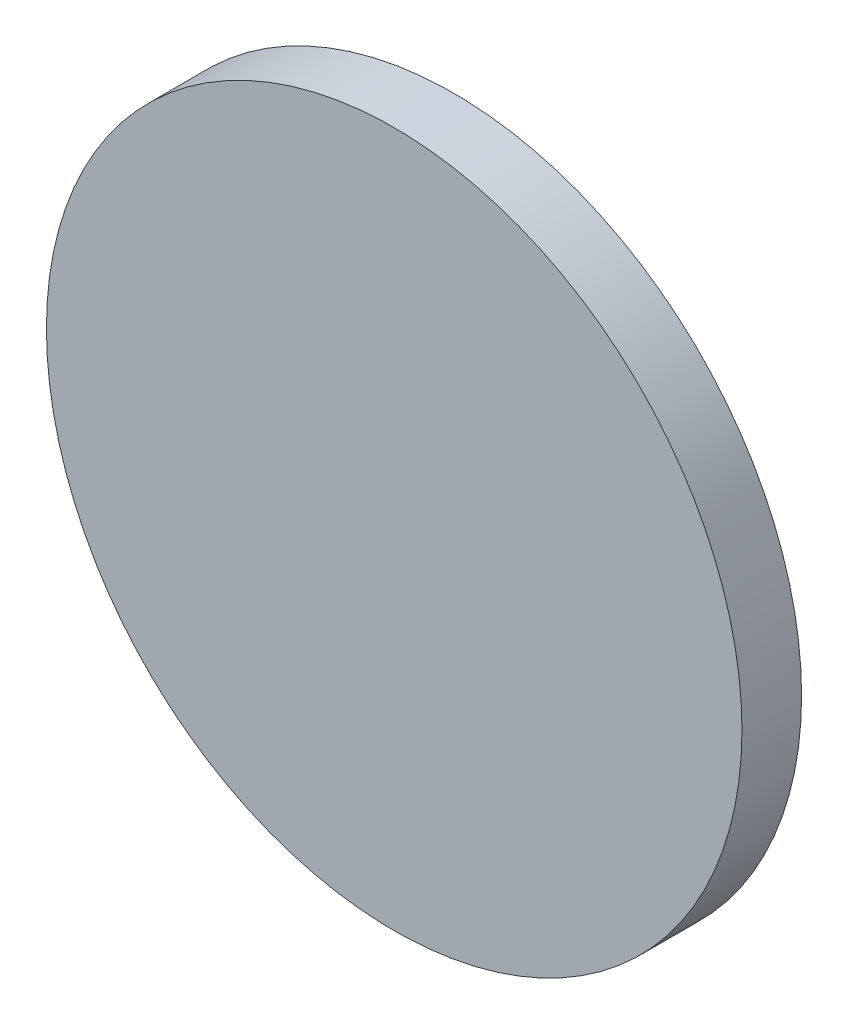
ISO-10303-21;
HEADER;
FILE_DESCRIPTION(('STEP AP214'),'2;1');
FILE_NAME('part.step','',(''),(''),'','','');
FILE_SCHEMA(('AUTOMOTIVE_DESIGN { 1 0 10303 214 1 1 1 1 }'));
ENDSEC;
DATA;
#1=APPLICATION_CONTEXT('core data for automotive mechanical design processes');
#2=APPLICATION_PROTOCOL_DEFINITION('international standard','automotive_design',2000,#1);
#3=PRODUCT_CONTEXT('',#1,'mechanical');
#4=PRODUCT('Part','Part','',(#3));
#5=PRODUCT_RELATED_PRODUCT_CATEGORY('part','',(#4));
#6=PRODUCT_DEFINITION_FORMATION('','',#4);
#7=PRODUCT_DEFINITION_CONTEXT('part definition',#1,'design');
#8=PRODUCT_DEFINITION('design','',#6,#7);
#9=PRODUCT_DEFINITION_SHAPE('','',#8);
#10=(LENGTH_UNIT() NAMED_UNIT(*) SI_UNIT(.MILLI.,.METRE.));
#11=(NAMED_UNIT(*) PLANE_ANGLE_UNIT() SI_UNIT($,.RADIAN.));
#12=(NAMED_UNIT(*) SI_UNIT($,.STERADIAN.) SOLID_ANGLE_UNIT());
#13=UNCERTAINTY_MEASURE_WITH_UNIT(LENGTH_MEASURE(1.E-05),#10,'distance_accuracy_value','');
#14=(GEOMETRIC_REPRESENTATION_CONTEXT(3) GLOBAL_UNCERTAINTY_ASSIGNED_CONTEXT((#13)) GLOBAL_UNIT_ASSIGNED_CONTEXT((#10,
#11,#12)) REPRESENTATION_CONTEXT('',''));
#15=CARTESIAN_POINT('',(0.,0.,0.));
#16=DIRECTION('',(0.,0.,1.));
#17=DIRECTION('',(1.,0.,0.));
#18=AXIS2_PLACEMENT_3D('',#15,#16,#17);
#19=CARTESIAN_POINT('',(1.651,8.985250006176,0.79916));
#20=DIRECTION('',(0.,0.,1.));
#21=DIRECTION('',(1.,0.,0.));
#22=AXIS2_PLACEMENT_3D('',#19,#20,#21);
#23=PLANE('',#22);
#24=CARTESIAN_POINT('',(1.651,8.985250006176,0.79916));
#25=DIRECTION('',(0.,0.,1.));
#26=DIRECTION('',(1.,0.,0.));
#27=AXIS2_PLACEMENT_3D('',#24,#25,#26);
#28=CIRCLE('',#27,0.200024667);
#29=CARTESIAN_POINT('',(1.851024667,8.985250006176,0.79916));
#30=VERTEX_POINT('',#29);
#31=EDGE_CURVE('E18',#30,#30,#28,.F.);
#32=ORIENTED_EDGE('',*,*,#31,.F.);
#33=EDGE_LOOP('',(#32));
#34=FACE_BOUND('',#33,.T.);
#35=ADVANCED_FACE('F15',(#34),#23,.T.);
#36=CARTESIAN_POINT('',(1.651,8.985250006176,0.76487));
#37=DIRECTION('',(0.,0.,1.));
#38=DIRECTION('',(1.,0.,0.));
#39=AXIS2_PLACEMENT_3D('',#36,#37,#38);
#40=CYLINDRICAL_SURFACE('',#39,0.200024667);
#41=ORIENTED_EDGE('',*,*,#31,.T.);
#42=EDGE_LOOP('',(#41));
#43=FACE_BOUND('',#42,.T.);
#44=CARTESIAN_POINT('',(1.651,8.985250006176,0.76487));
#45=DIRECTION('',(0.,0.,1.));
#46=DIRECTION('',(1.,0.,0.));
#47=AXIS2_PLACEMENT_3D('',#44,#45,#46);
#48=CIRCLE('',#47,0.200024667);
#49=CARTESIAN_POINT('',(1.851024667,8.985250006176,0.76487));
#50=VERTEX_POINT('',#49);
#51=EDGE_CURVE('E10',#50,#50,#48,.F.);
#52=ORIENTED_EDGE('',*,*,#51,.F.);
#53=EDGE_LOOP('',(#52));
#54=FACE_BOUND('',#53,.T.);
#55=ADVANCED_FACE('F27',(#43,#54),#40,.T.);
#56=CARTESIAN_POINT('',(1.651,8.985250006176,0.76487));
#57=DIRECTION('',(0.,0.,-1.));
#58=DIRECTION('',(-1.,0.,0.));
#59=AXIS2_PLACEMENT_3D('',#56,#57,#58);
#60=PLANE('',#59);
#61=ORIENTED_EDGE('',*,*,#51,.T.);
#62=EDGE_LOOP('',(#61));
#63=FACE_BOUND('',#62,.T.);
#64=ADVANCED_FACE('F35',(#63),#60,.T.);
#65=CLOSED_SHELL('',(#35,#55,#64));
#66=MANIFOLD_SOLID_BREP('B1',#65);
#67=ADVANCED_BREP_SHAPE_REPRESENTATION('',(#18,#66),#14);
#68=SHAPE_DEFINITION_REPRESENTATION(#9,#67);
ENDSEC;
END-ISO-10303-21;
